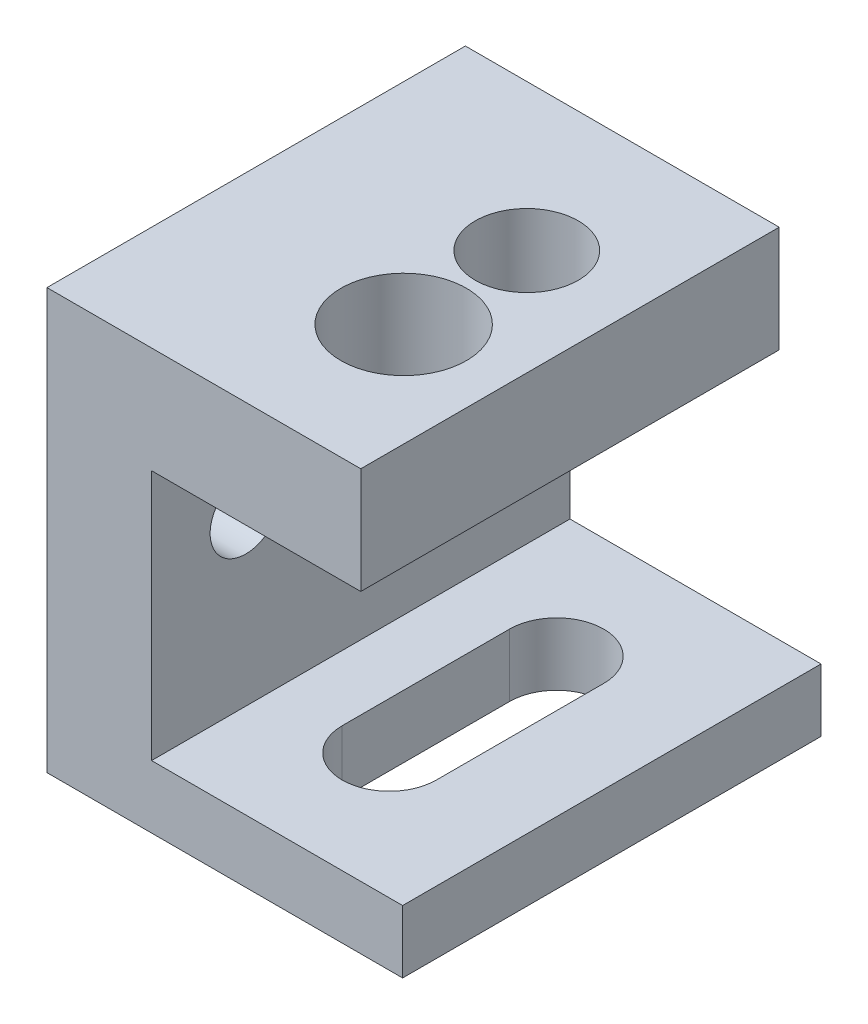
ISO-10303-21;
HEADER;
FILE_DESCRIPTION(('STEP AP214'),'2;1');
FILE_NAME('part.step','',(''),(''),'','','');
FILE_SCHEMA(('AUTOMOTIVE_DESIGN { 1 0 10303 214 1 1 1 1 }'));
ENDSEC;
DATA;
#1=APPLICATION_CONTEXT('core data for automotive mechanical design processes');
#2=APPLICATION_PROTOCOL_DEFINITION('international standard','automotive_design',2000,#1);
#3=PRODUCT_CONTEXT('',#1,'mechanical');
#4=PRODUCT('Part','Part','',(#3));
#5=PRODUCT_RELATED_PRODUCT_CATEGORY('part','',(#4));
#6=PRODUCT_DEFINITION_FORMATION('','',#4);
#7=PRODUCT_DEFINITION_CONTEXT('part definition',#1,'design');
#8=PRODUCT_DEFINITION('design','',#6,#7);
#9=PRODUCT_DEFINITION_SHAPE('','',#8);
#10=(LENGTH_UNIT() NAMED_UNIT(*) SI_UNIT(.MILLI.,.METRE.));
#11=(NAMED_UNIT(*) PLANE_ANGLE_UNIT() SI_UNIT($,.RADIAN.));
#12=(NAMED_UNIT(*) SI_UNIT($,.STERADIAN.) SOLID_ANGLE_UNIT());
#13=UNCERTAINTY_MEASURE_WITH_UNIT(LENGTH_MEASURE(1.E-05),#10,'distance_accuracy_value','');
#14=(GEOMETRIC_REPRESENTATION_CONTEXT(3) GLOBAL_UNCERTAINTY_ASSIGNED_CONTEXT((#13)) GLOBAL_UNIT_ASSIGNED_CONTEXT((#10,
#11,#12)) REPRESENTATION_CONTEXT('',''));
#15=CARTESIAN_POINT('',(0.,0.,0.));
#16=DIRECTION('',(0.,0.,1.));
#17=DIRECTION('',(1.,0.,0.));
#18=AXIS2_PLACEMENT_3D('',#15,#16,#17);
#19=CARTESIAN_POINT('',(-2.5,-15.,-10.));
#20=DIRECTION('',(-1.,0.,0.));
#21=DIRECTION('',(0.,0.,1.));
#22=AXIS2_PLACEMENT_3D('',#19,#20,#21);
#23=PLANE('',#22);
#24=CARTESIAN_POINT('',(-2.5,-4.,5.5));
#25=DIRECTION('',(1.,0.,0.));
#26=DIRECTION('',(0.,0.,-1.));
#27=AXIS2_PLACEMENT_3D('',#24,#25,#26);
#28=CIRCLE('',#27,1.69999999999999);
#29=CARTESIAN_POINT('',(-2.5,-4.,3.80000000000001));
#30=VERTEX_POINT('',#29);
#31=EDGE_CURVE('E187',#30,#30,#28,.T.);
#32=ORIENTED_EDGE('',*,*,#31,.F.);
#33=EDGE_LOOP('',(#32));
#34=FACE_BOUND('',#33,.T.);
#35=CARTESIAN_POINT('',(-2.5,-4.,-5.5));
#36=DIRECTION('',(1.,0.,0.));
#37=DIRECTION('',(0.,0.,-1.));
#38=AXIS2_PLACEMENT_3D('',#35,#36,#37);
#39=CIRCLE('',#38,1.69999999999999);
#40=CARTESIAN_POINT('',(-2.5,-4.,-7.19999999999999));
#41=VERTEX_POINT('',#40);
#42=EDGE_CURVE('E181',#41,#41,#39,.T.);
#43=ORIENTED_EDGE('',*,*,#42,.F.);
#44=EDGE_LOOP('',(#43));
#45=FACE_BOUND('',#44,.T.);
#46=DIRECTION('',(0.,0.,1.));
#47=VECTOR('',#46,1.);
#48=CARTESIAN_POINT('',(-2.5,-12.,-10.));
#49=LINE('',#48,#47);
#50=CARTESIAN_POINT('',(-2.5,-12.,-10.));
#51=VERTEX_POINT('',#50);
#52=CARTESIAN_POINT('',(-2.5,-12.,10.));
#53=VERTEX_POINT('',#52);
#54=EDGE_CURVE('E163',#51,#53,#49,.T.);
#55=ORIENTED_EDGE('',*,*,#54,.F.);
#56=DIRECTION('',(0.,1.,0.));
#57=VECTOR('',#56,1.);
#58=CARTESIAN_POINT('',(-2.5,-15.,-10.));
#59=LINE('',#58,#57);
#60=CARTESIAN_POINT('',(-2.5,0.,-10.));
#61=VERTEX_POINT('',#60);
#62=EDGE_CURVE('E219',#51,#61,#59,.T.);
#63=ORIENTED_EDGE('',*,*,#62,.T.);
#64=DIRECTION('',(0.,0.,1.));
#65=VECTOR('',#64,1.);
#66=CARTESIAN_POINT('',(-2.5,0.,-10.));
#67=LINE('',#66,#65);
#68=CARTESIAN_POINT('',(-2.5,0.,10.));
#69=VERTEX_POINT('',#68);
#70=EDGE_CURVE('E193',#61,#69,#67,.T.);
#71=ORIENTED_EDGE('',*,*,#70,.T.);
#72=DIRECTION('',(0.,1.,0.));
#73=VECTOR('',#72,1.);
#74=CARTESIAN_POINT('',(-2.5,-15.,10.));
#75=LINE('',#74,#73);
#76=EDGE_CURVE('E202',#53,#69,#75,.T.);
#77=ORIENTED_EDGE('',*,*,#76,.F.);
#78=EDGE_LOOP('',(#55,#63,#71,#77));
#79=FACE_BOUND('',#78,.T.);
#80=ADVANCED_FACE('F34',(#34,#45,#79),#23,.F.);
#81=CARTESIAN_POINT('',(0.,0.,0.));
#82=DIRECTION('',(0.,1.,0.));
#83=DIRECTION('',(0.,0.,1.));
#84=AXIS2_PLACEMENT_3D('',#81,#82,#83);
#85=PLANE('',#84);
#86=CARTESIAN_POINT('',(2.55115397628103,0.,3.));
#87=DIRECTION('',(0.,1.,0.));
#88=DIRECTION('',(0.,0.,1.));
#89=AXIS2_PLACEMENT_3D('',#86,#87,#88);
#90=CIRCLE('',#89,3.);
#91=CARTESIAN_POINT('',(2.55115397628103,0.,6.));
#92=VERTEX_POINT('',#91);
#93=EDGE_CURVE('E154',#92,#92,#90,.T.);
#94=ORIENTED_EDGE('',*,*,#93,.T.);
#95=EDGE_LOOP('',(#94));
#96=FACE_BOUND('',#95,.T.);
#97=CARTESIAN_POINT('',(2.43515046506104,0.,-3.));
#98=DIRECTION('',(0.,1.,0.));
#99=DIRECTION('',(0.,0.,1.));
#100=AXIS2_PLACEMENT_3D('',#97,#98,#99);
#101=CIRCLE('',#100,2.4638);
#102=CARTESIAN_POINT('',(2.43515046506104,0.,-0.536200000000003));
#103=VERTEX_POINT('',#102);
#104=EDGE_CURVE('E160',#103,#103,#101,.T.);
#105=ORIENTED_EDGE('',*,*,#104,.T.);
#106=EDGE_LOOP('',(#105));
#107=FACE_BOUND('',#106,.T.);
#108=ORIENTED_EDGE('',*,*,#70,.F.);
#109=DIRECTION('',(-1.,0.,0.));
#110=VECTOR('',#109,1.);
#111=CARTESIAN_POINT('',(7.5,0.,-10.));
#112=LINE('',#111,#110);
#113=CARTESIAN_POINT('',(7.5,0.,-10.));
#114=VERTEX_POINT('',#113);
#115=EDGE_CURVE('E309',#114,#61,#112,.T.);
#116=ORIENTED_EDGE('',*,*,#115,.F.);
#117=DIRECTION('',(0.,0.,-1.));
#118=VECTOR('',#117,1.);
#119=CARTESIAN_POINT('',(7.5,0.,10.));
#120=LINE('',#119,#118);
#121=CARTESIAN_POINT('',(7.5,0.,10.));
#122=VERTEX_POINT('',#121);
#123=EDGE_CURVE('E312',#122,#114,#120,.T.);
#124=ORIENTED_EDGE('',*,*,#123,.F.);
#125=DIRECTION('',(1.,0.,0.));
#126=VECTOR('',#125,1.);
#127=CARTESIAN_POINT('',(7.5,0.,10.));
#128=LINE('',#127,#126);
#129=EDGE_CURVE('E211',#69,#122,#128,.T.);
#130=ORIENTED_EDGE('',*,*,#129,.F.);
#131=EDGE_LOOP('',(#108,#116,#124,#130));
#132=FACE_BOUND('',#131,.T.);
#133=ADVANCED_FACE('F245',(#96,#107,#132),#85,.F.);
#134=CARTESIAN_POINT('',(-7.5,5.08,10.));
#135=DIRECTION('',(1.,0.,0.));
#136=DIRECTION('',(0.,0.,-1.));
#137=AXIS2_PLACEMENT_3D('',#134,#135,#136);
#138=PLANE('',#137);
#139=CARTESIAN_POINT('',(-7.5,-4.,-5.5));
#140=DIRECTION('',(1.,0.,0.));
#141=DIRECTION('',(0.,0.,-1.));
#142=AXIS2_PLACEMENT_3D('',#139,#140,#141);
#143=CIRCLE('',#142,1.7);
#144=CARTESIAN_POINT('',(-7.5,-4.,-7.2));
#145=VERTEX_POINT('',#144);
#146=EDGE_CURVE('E184',#145,#145,#143,.T.);
#147=ORIENTED_EDGE('',*,*,#146,.T.);
#148=EDGE_LOOP('',(#147));
#149=FACE_BOUND('',#148,.T.);
#150=CARTESIAN_POINT('',(-7.50000000000001,-4.,5.5));
#151=DIRECTION('',(1.,0.,0.));
#152=DIRECTION('',(0.,0.,-1.));
#153=AXIS2_PLACEMENT_3D('',#150,#151,#152);
#154=CIRCLE('',#153,1.7);
#155=CARTESIAN_POINT('',(-7.50000000000001,-4.,3.8));
#156=VERTEX_POINT('',#155);
#157=EDGE_CURVE('E190',#156,#156,#154,.T.);
#158=ORIENTED_EDGE('',*,*,#157,.T.);
#159=EDGE_LOOP('',(#158));
#160=FACE_BOUND('',#159,.T.);
#161=DIRECTION('',(0.,-1.,0.));
#162=VECTOR('',#161,1.);
#163=CARTESIAN_POINT('',(-7.5,5.08,-10.));
#164=LINE('',#163,#162);
#165=CARTESIAN_POINT('',(-7.5,5.08,-10.));
#166=VERTEX_POINT('',#165);
#167=CARTESIAN_POINT('',(-7.5,-15.,-10.));
#168=VERTEX_POINT('',#167);
#169=EDGE_CURVE('E288',#166,#168,#164,.T.);
#170=ORIENTED_EDGE('',*,*,#169,.T.);
#171=DIRECTION('',(0.,0.,-1.));
#172=VECTOR('',#171,1.);
#173=CARTESIAN_POINT('',(-7.5,-15.,-10.));
#174=LINE('',#173,#172);
#175=CARTESIAN_POINT('',(-7.5,-15.,10.));
#176=VERTEX_POINT('',#175);
#177=EDGE_CURVE('E194',#176,#168,#174,.T.);
#178=ORIENTED_EDGE('',*,*,#177,.F.);
#179=DIRECTION('',(0.,-1.,0.));
#180=VECTOR('',#179,1.);
#181=CARTESIAN_POINT('',(-7.5,5.08,10.));
#182=LINE('',#181,#180);
#183=CARTESIAN_POINT('',(-7.5,5.08,10.));
#184=VERTEX_POINT('',#183);
#185=EDGE_CURVE('E223',#184,#176,#182,.T.);
#186=ORIENTED_EDGE('',*,*,#185,.F.);
#187=DIRECTION('',(0.,0.,1.));
#188=VECTOR('',#187,1.);
#189=CARTESIAN_POINT('',(-7.5,5.08,10.));
#190=LINE('',#189,#188);
#191=EDGE_CURVE('E205',#166,#184,#190,.T.);
#192=ORIENTED_EDGE('',*,*,#191,.F.);
#193=EDGE_LOOP('',(#170,#178,#186,#192));
#194=FACE_BOUND('',#193,.T.);
#195=ADVANCED_FACE('F36',(#149,#160,#194),#138,.F.);
#196=CARTESIAN_POINT('',(7.5,5.08,10.));
#197=DIRECTION('',(0.,0.,-1.));
#198=DIRECTION('',(-1.,0.,0.));
#199=AXIS2_PLACEMENT_3D('',#196,#197,#198);
#200=PLANE('',#199);
#201=ORIENTED_EDGE('',*,*,#185,.T.);
#202=DIRECTION('',(-1.,0.,0.));
#203=VECTOR('',#202,1.);
#204=CARTESIAN_POINT('',(-7.5,-15.,10.));
#205=LINE('',#204,#203);
#206=CARTESIAN_POINT('',(9.5,-15.,10.));
#207=VERTEX_POINT('',#206);
#208=EDGE_CURVE('E199',#207,#176,#205,.T.);
#209=ORIENTED_EDGE('',*,*,#208,.F.);
#210=DIRECTION('',(0.,-1.,0.));
#211=VECTOR('',#210,1.);
#212=CARTESIAN_POINT('',(9.5,-15.,10.));
#213=LINE('',#212,#211);
#214=CARTESIAN_POINT('',(9.5,-12.,10.));
#215=VERTEX_POINT('',#214);
#216=EDGE_CURVE('E169',#215,#207,#213,.T.);
#217=ORIENTED_EDGE('',*,*,#216,.F.);
#218=DIRECTION('',(-1.,0.,0.));
#219=VECTOR('',#218,1.);
#220=CARTESIAN_POINT('',(9.5,-12.,10.));
#221=LINE('',#220,#219);
#222=EDGE_CURVE('E175',#215,#53,#221,.T.);
#223=ORIENTED_EDGE('',*,*,#222,.T.);
#224=ORIENTED_EDGE('',*,*,#76,.T.);
#225=ORIENTED_EDGE('',*,*,#129,.T.);
#226=DIRECTION('',(0.,-1.,0.));
#227=VECTOR('',#226,1.);
#228=CARTESIAN_POINT('',(7.5,5.08,10.));
#229=LINE('',#228,#227);
#230=CARTESIAN_POINT('',(7.5,5.08,10.));
#231=VERTEX_POINT('',#230);
#232=EDGE_CURVE('E284',#231,#122,#229,.T.);
#233=ORIENTED_EDGE('',*,*,#232,.F.);
#234=DIRECTION('',(1.,0.,0.));
#235=VECTOR('',#234,1.);
#236=CARTESIAN_POINT('',(7.5,5.08,10.));
#237=LINE('',#236,#235);
#238=EDGE_CURVE('E279',#184,#231,#237,.T.);
#239=ORIENTED_EDGE('',*,*,#238,.F.);
#240=EDGE_LOOP('',(#201,#209,#217,#223,#224,#225,#233,#239));
#241=FACE_BOUND('',#240,.T.);
#242=ADVANCED_FACE('F268',(#241),#200,.F.);
#243=CARTESIAN_POINT('',(7.5,5.08,10.));
#244=DIRECTION('',(-1.,0.,0.));
#245=DIRECTION('',(0.,0.,1.));
#246=AXIS2_PLACEMENT_3D('',#243,#244,#245);
#247=PLANE('',#246);
#248=ORIENTED_EDGE('',*,*,#123,.T.);
#249=DIRECTION('',(0.,-1.,0.));
#250=VECTOR('',#249,1.);
#251=CARTESIAN_POINT('',(7.5,5.08,-10.));
#252=LINE('',#251,#250);
#253=CARTESIAN_POINT('',(7.5,5.08,-10.));
#254=VERTEX_POINT('',#253);
#255=EDGE_CURVE('E291',#254,#114,#252,.T.);
#256=ORIENTED_EDGE('',*,*,#255,.F.);
#257=DIRECTION('',(0.,0.,-1.));
#258=VECTOR('',#257,1.);
#259=CARTESIAN_POINT('',(7.5,5.08,10.));
#260=LINE('',#259,#258);
#261=EDGE_CURVE('E320',#231,#254,#260,.T.);
#262=ORIENTED_EDGE('',*,*,#261,.F.);
#263=ORIENTED_EDGE('',*,*,#232,.T.);
#264=EDGE_LOOP('',(#248,#256,#262,#263));
#265=FACE_BOUND('',#264,.T.);
#266=ADVANCED_FACE('F265',(#265),#247,.F.);
#267=CARTESIAN_POINT('',(7.5,5.08,-10.));
#268=DIRECTION('',(0.,0.,1.));
#269=DIRECTION('',(1.,0.,0.));
#270=AXIS2_PLACEMENT_3D('',#267,#268,#269);
#271=PLANE('',#270);
#272=ORIENTED_EDGE('',*,*,#115,.T.);
#273=ORIENTED_EDGE('',*,*,#62,.F.);
#274=DIRECTION('',(-1.,0.,0.));
#275=VECTOR('',#274,1.);
#276=CARTESIAN_POINT('',(9.5,-12.,-10.));
#277=LINE('',#276,#275);
#278=CARTESIAN_POINT('',(9.5,-12.,-10.));
#279=VERTEX_POINT('',#278);
#280=EDGE_CURVE('E179',#279,#51,#277,.T.);
#281=ORIENTED_EDGE('',*,*,#280,.F.);
#282=DIRECTION('',(0.,1.,0.));
#283=VECTOR('',#282,1.);
#284=CARTESIAN_POINT('',(9.5,-15.,-10.));
#285=LINE('',#284,#283);
#286=CARTESIAN_POINT('',(9.5,-15.,-10.));
#287=VERTEX_POINT('',#286);
#288=EDGE_CURVE('E164',#287,#279,#285,.T.);
#289=ORIENTED_EDGE('',*,*,#288,.F.);
#290=DIRECTION('',(1.,0.,0.));
#291=VECTOR('',#290,1.);
#292=CARTESIAN_POINT('',(-7.5,-15.,-10.));
#293=LINE('',#292,#291);
#294=EDGE_CURVE('E197',#168,#287,#293,.T.);
#295=ORIENTED_EDGE('',*,*,#294,.F.);
#296=ORIENTED_EDGE('',*,*,#169,.F.);
#297=DIRECTION('',(-1.,0.,0.));
#298=VECTOR('',#297,1.);
#299=CARTESIAN_POINT('',(7.5,5.08,-10.));
#300=LINE('',#299,#298);
#301=EDGE_CURVE('E292',#254,#166,#300,.T.);
#302=ORIENTED_EDGE('',*,*,#301,.F.);
#303=ORIENTED_EDGE('',*,*,#255,.T.);
#304=EDGE_LOOP('',(#272,#273,#281,#289,#295,#296,#302,#303));
#305=FACE_BOUND('',#304,.T.);
#306=ADVANCED_FACE('F260',(#305),#271,.F.);
#307=CARTESIAN_POINT('',(0.,5.08,0.));
#308=DIRECTION('',(0.,1.,0.));
#309=DIRECTION('',(0.,0.,1.));
#310=AXIS2_PLACEMENT_3D('',#307,#308,#309);
#311=PLANE('',#310);
#312=CARTESIAN_POINT('',(2.55115397628103,5.08,3.));
#313=DIRECTION('',(0.,1.,0.));
#314=DIRECTION('',(0.,0.,1.));
#315=AXIS2_PLACEMENT_3D('',#312,#313,#314);
#316=CIRCLE('',#315,3.);
#317=CARTESIAN_POINT('',(2.55115397628103,5.08,6.));
#318=VERTEX_POINT('',#317);
#319=EDGE_CURVE('E149',#318,#318,#316,.T.);
#320=ORIENTED_EDGE('',*,*,#319,.F.);
#321=EDGE_LOOP('',(#320));
#322=FACE_BOUND('',#321,.T.);
#323=CARTESIAN_POINT('',(2.43515046506104,5.08,-3.));
#324=DIRECTION('',(0.,1.,0.));
#325=DIRECTION('',(0.,0.,1.));
#326=AXIS2_PLACEMENT_3D('',#323,#324,#325);
#327=CIRCLE('',#326,2.4638);
#328=CARTESIAN_POINT('',(2.43515046506104,5.08,-0.536200000000003));
#329=VERTEX_POINT('',#328);
#330=EDGE_CURVE('E157',#329,#329,#327,.T.);
#331=ORIENTED_EDGE('',*,*,#330,.F.);
#332=EDGE_LOOP('',(#331));
#333=FACE_BOUND('',#332,.T.);
#334=ORIENTED_EDGE('',*,*,#191,.T.);
#335=ORIENTED_EDGE('',*,*,#238,.T.);
#336=ORIENTED_EDGE('',*,*,#261,.T.);
#337=ORIENTED_EDGE('',*,*,#301,.T.);
#338=EDGE_LOOP('',(#334,#335,#336,#337));
#339=FACE_BOUND('',#338,.T.);
#340=ADVANCED_FACE('F258',(#322,#333,#339),#311,.T.);
#341=CARTESIAN_POINT('',(0.,-15.,0.));
#342=DIRECTION('',(0.,1.,0.));
#343=DIRECTION('',(0.,0.,1.));
#344=AXIS2_PLACEMENT_3D('',#341,#342,#343);
#345=PLANE('',#344);
#346=DIRECTION('',(0.,0.,1.));
#347=VECTOR('',#346,1.);
#348=CARTESIAN_POINT('',(5.11152957496108,-15.,-4.));
#349=LINE('',#348,#347);
#350=CARTESIAN_POINT('',(5.11152957496108,-15.,-4.));
#351=VERTEX_POINT('',#350);
#352=CARTESIAN_POINT('',(5.11152957496108,-15.,4.));
#353=VERTEX_POINT('',#352);
#354=EDGE_CURVE('E135',#351,#353,#349,.T.);
#355=ORIENTED_EDGE('',*,*,#354,.F.);
#356=CARTESIAN_POINT('',(2.86152957496108,-15.,-4.));
#357=DIRECTION('',(0.,-1.,0.));
#358=DIRECTION('',(0.,0.,-1.));
#359=AXIS2_PLACEMENT_3D('',#356,#357,#358);
#360=CIRCLE('',#359,2.25);
#361=CARTESIAN_POINT('',(0.611529574961084,-15.,-4.));
#362=VERTEX_POINT('',#361);
#363=EDGE_CURVE('E49',#362,#351,#360,.T.);
#364=ORIENTED_EDGE('',*,*,#363,.F.);
#365=DIRECTION('',(0.,0.,-1.));
#366=VECTOR('',#365,1.);
#367=CARTESIAN_POINT('',(0.611529574961084,-15.,-4.));
#368=LINE('',#367,#366);
#369=CARTESIAN_POINT('',(0.611529574961084,-15.,4.));
#370=VERTEX_POINT('',#369);
#371=EDGE_CURVE('E142',#370,#362,#368,.T.);
#372=ORIENTED_EDGE('',*,*,#371,.F.);
#373=CARTESIAN_POINT('',(2.86152957496108,-15.,4.));
#374=DIRECTION('',(0.,-1.,0.));
#375=DIRECTION('',(0.,0.,-1.));
#376=AXIS2_PLACEMENT_3D('',#373,#374,#375);
#377=CIRCLE('',#376,2.25);
#378=EDGE_CURVE('E126',#353,#370,#377,.T.);
#379=ORIENTED_EDGE('',*,*,#378,.F.);
#380=EDGE_LOOP('',(#355,#364,#372,#379));
#381=FACE_BOUND('',#380,.T.);
#382=ORIENTED_EDGE('',*,*,#177,.T.);
#383=ORIENTED_EDGE('',*,*,#294,.T.);
#384=DIRECTION('',(0.,0.,-1.));
#385=VECTOR('',#384,1.);
#386=CARTESIAN_POINT('',(9.5,-15.,-10.));
#387=LINE('',#386,#385);
#388=EDGE_CURVE('E172',#207,#287,#387,.T.);
#389=ORIENTED_EDGE('',*,*,#388,.F.);
#390=ORIENTED_EDGE('',*,*,#208,.T.);
#391=EDGE_LOOP('',(#382,#383,#389,#390));
#392=FACE_BOUND('',#391,.T.);
#393=ADVANCED_FACE('F139',(#381,#392),#345,.F.);
#394=CARTESIAN_POINT('',(-2.5,-4.,5.5));
#395=DIRECTION('',(1.,0.,0.));
#396=DIRECTION('',(0.,0.,-1.));
#397=AXIS2_PLACEMENT_3D('',#394,#395,#396);
#398=CYLINDRICAL_SURFACE('',#397,1.69999999999999);
#399=ORIENTED_EDGE('',*,*,#157,.F.);
#400=EDGE_LOOP('',(#399));
#401=FACE_BOUND('',#400,.T.);
#402=ORIENTED_EDGE('',*,*,#31,.T.);
#403=EDGE_LOOP('',(#402));
#404=FACE_BOUND('',#403,.T.);
#405=ADVANCED_FACE('F333',(#401,#404),#398,.F.);
#406=CARTESIAN_POINT('',(-2.5,-4.,-5.5));
#407=DIRECTION('',(1.,0.,0.));
#408=DIRECTION('',(0.,0.,-1.));
#409=AXIS2_PLACEMENT_3D('',#406,#407,#408);
#410=CYLINDRICAL_SURFACE('',#409,1.69999999999999);
#411=ORIENTED_EDGE('',*,*,#146,.F.);
#412=EDGE_LOOP('',(#411));
#413=FACE_BOUND('',#412,.T.);
#414=ORIENTED_EDGE('',*,*,#42,.T.);
#415=EDGE_LOOP('',(#414));
#416=FACE_BOUND('',#415,.T.);
#417=ADVANCED_FACE('F326',(#413,#416),#410,.F.);
#418=CARTESIAN_POINT('',(9.5,-12.,-10.));
#419=DIRECTION('',(0.,-1.,0.));
#420=DIRECTION('',(0.,0.,-1.));
#421=AXIS2_PLACEMENT_3D('',#418,#419,#420);
#422=PLANE('',#421);
#423=DIRECTION('',(0.,0.,-1.));
#424=VECTOR('',#423,1.);
#425=CARTESIAN_POINT('',(0.611529574961084,-12.,-10.));
#426=LINE('',#425,#424);
#427=CARTESIAN_POINT('',(0.611529574961084,-12.,4.));
#428=VERTEX_POINT('',#427);
#429=CARTESIAN_POINT('',(0.611529574961084,-12.,-4.));
#430=VERTEX_POINT('',#429);
#431=EDGE_CURVE('E42',#428,#430,#426,.T.);
#432=ORIENTED_EDGE('',*,*,#431,.T.);
#433=CARTESIAN_POINT('',(2.86152957496108,-12.,-4.));
#434=DIRECTION('',(0.,-1.,0.));
#435=DIRECTION('',(0.,0.,-1.));
#436=AXIS2_PLACEMENT_3D('',#433,#434,#435);
#437=CIRCLE('',#436,2.25);
#438=CARTESIAN_POINT('',(5.11152957496108,-12.,-4.));
#439=VERTEX_POINT('',#438);
#440=EDGE_CURVE('E11',#430,#439,#437,.T.);
#441=ORIENTED_EDGE('',*,*,#440,.T.);
#442=DIRECTION('',(0.,0.,1.));
#443=VECTOR('',#442,1.);
#444=CARTESIAN_POINT('',(5.11152957496108,-12.,-10.));
#445=LINE('',#444,#443);
#446=CARTESIAN_POINT('',(5.11152957496108,-12.,4.));
#447=VERTEX_POINT('',#446);
#448=EDGE_CURVE('E221',#439,#447,#445,.T.);
#449=ORIENTED_EDGE('',*,*,#448,.T.);
#450=CARTESIAN_POINT('',(2.86152957496108,-12.,4.));
#451=DIRECTION('',(0.,-1.,0.));
#452=DIRECTION('',(0.,0.,-1.));
#453=AXIS2_PLACEMENT_3D('',#450,#451,#452);
#454=CIRCLE('',#453,2.25);
#455=EDGE_CURVE('E129',#447,#428,#454,.T.);
#456=ORIENTED_EDGE('',*,*,#455,.T.);
#457=EDGE_LOOP('',(#432,#441,#449,#456));
#458=FACE_BOUND('',#457,.T.);
#459=ORIENTED_EDGE('',*,*,#54,.T.);
#460=ORIENTED_EDGE('',*,*,#222,.F.);
#461=DIRECTION('',(0.,0.,1.));
#462=VECTOR('',#461,1.);
#463=CARTESIAN_POINT('',(9.5,-12.,-10.));
#464=LINE('',#463,#462);
#465=EDGE_CURVE('E167',#279,#215,#464,.T.);
#466=ORIENTED_EDGE('',*,*,#465,.F.);
#467=ORIENTED_EDGE('',*,*,#280,.T.);
#468=EDGE_LOOP('',(#459,#460,#466,#467));
#469=FACE_BOUND('',#468,.T.);
#470=ADVANCED_FACE('F226',(#458,#469),#422,.F.);
#471=CARTESIAN_POINT('',(9.5,0.,0.));
#472=DIRECTION('',(1.,0.,0.));
#473=DIRECTION('',(0.,0.,-1.));
#474=AXIS2_PLACEMENT_3D('',#471,#472,#473);
#475=PLANE('',#474);
#476=ORIENTED_EDGE('',*,*,#288,.T.);
#477=ORIENTED_EDGE('',*,*,#465,.T.);
#478=ORIENTED_EDGE('',*,*,#216,.T.);
#479=ORIENTED_EDGE('',*,*,#388,.T.);
#480=EDGE_LOOP('',(#476,#477,#478,#479));
#481=FACE_BOUND('',#480,.T.);
#482=ADVANCED_FACE('F298',(#481),#475,.T.);
#483=CARTESIAN_POINT('',(2.43515046506104,-6.92,-3.));
#484=DIRECTION('',(0.,1.,0.));
#485=DIRECTION('',(0.,0.,1.));
#486=AXIS2_PLACEMENT_3D('',#483,#484,#485);
#487=CYLINDRICAL_SURFACE('',#486,2.4638);
#488=ORIENTED_EDGE('',*,*,#330,.T.);
#489=EDGE_LOOP('',(#488));
#490=FACE_BOUND('',#489,.T.);
#491=ORIENTED_EDGE('',*,*,#104,.F.);
#492=EDGE_LOOP('',(#491));
#493=FACE_BOUND('',#492,.T.);
#494=ADVANCED_FACE('F240',(#490,#493),#487,.F.);
#495=CARTESIAN_POINT('',(2.55115397628103,-6.92,3.));
#496=DIRECTION('',(0.,1.,0.));
#497=DIRECTION('',(0.,0.,1.));
#498=AXIS2_PLACEMENT_3D('',#495,#496,#497);
#499=CYLINDRICAL_SURFACE('',#498,3.);
#500=ORIENTED_EDGE('',*,*,#319,.T.);
#501=EDGE_LOOP('',(#500));
#502=FACE_BOUND('',#501,.T.);
#503=ORIENTED_EDGE('',*,*,#93,.F.);
#504=EDGE_LOOP('',(#503));
#505=FACE_BOUND('',#504,.T.);
#506=ADVANCED_FACE('F233',(#502,#505),#499,.F.);
#507=CARTESIAN_POINT('',(2.86152957496108,-3.,-4.));
#508=DIRECTION('',(0.,-1.,0.));
#509=DIRECTION('',(0.,0.,-1.));
#510=AXIS2_PLACEMENT_3D('',#507,#508,#509);
#511=CYLINDRICAL_SURFACE('',#510,2.25);
#512=DIRECTION('',(0.,-1.,0.));
#513=VECTOR('',#512,1.);
#514=CARTESIAN_POINT('',(0.611529574961084,-3.,-4.));
#515=LINE('',#514,#513);
#516=EDGE_CURVE('E147',#430,#362,#515,.T.);
#517=ORIENTED_EDGE('',*,*,#516,.T.);
#518=ORIENTED_EDGE('',*,*,#363,.T.);
#519=DIRECTION('',(0.,-1.,0.));
#520=VECTOR('',#519,1.);
#521=CARTESIAN_POINT('',(5.11152957496108,-3.,-4.));
#522=LINE('',#521,#520);
#523=EDGE_CURVE('E132',#439,#351,#522,.T.);
#524=ORIENTED_EDGE('',*,*,#523,.F.);
#525=ORIENTED_EDGE('',*,*,#440,.F.);
#526=EDGE_LOOP('',(#517,#518,#524,#525));
#527=FACE_BOUND('',#526,.T.);
#528=ADVANCED_FACE('F231',(#527),#511,.F.);
#529=CARTESIAN_POINT('',(0.611529574961084,-3.,-4.));
#530=DIRECTION('',(-1.,0.,0.));
#531=DIRECTION('',(0.,0.,1.));
#532=AXIS2_PLACEMENT_3D('',#529,#530,#531);
#533=PLANE('',#532);
#534=DIRECTION('',(0.,-1.,0.));
#535=VECTOR('',#534,1.);
#536=CARTESIAN_POINT('',(0.611529574961084,-3.,4.));
#537=LINE('',#536,#535);
#538=EDGE_CURVE('E131',#428,#370,#537,.T.);
#539=ORIENTED_EDGE('',*,*,#538,.T.);
#540=ORIENTED_EDGE('',*,*,#371,.T.);
#541=ORIENTED_EDGE('',*,*,#516,.F.);
#542=ORIENTED_EDGE('',*,*,#431,.F.);
#543=EDGE_LOOP('',(#539,#540,#541,#542));
#544=FACE_BOUND('',#543,.T.);
#545=ADVANCED_FACE('F230',(#544),#533,.F.);
#546=CARTESIAN_POINT('',(2.86152957496108,-3.,4.));
#547=DIRECTION('',(0.,-1.,0.));
#548=DIRECTION('',(0.,0.,-1.));
#549=AXIS2_PLACEMENT_3D('',#546,#547,#548);
#550=CYLINDRICAL_SURFACE('',#549,2.25);
#551=DIRECTION('',(0.,-1.,0.));
#552=VECTOR('',#551,1.);
#553=CARTESIAN_POINT('',(5.11152957496108,-3.,4.));
#554=LINE('',#553,#552);
#555=EDGE_CURVE('E57',#447,#353,#554,.T.);
#556=ORIENTED_EDGE('',*,*,#555,.T.);
#557=ORIENTED_EDGE('',*,*,#378,.T.);
#558=ORIENTED_EDGE('',*,*,#538,.F.);
#559=ORIENTED_EDGE('',*,*,#455,.F.);
#560=EDGE_LOOP('',(#556,#557,#558,#559));
#561=FACE_BOUND('',#560,.T.);
#562=ADVANCED_FACE('F123',(#561),#550,.F.);
#563=CARTESIAN_POINT('',(5.11152957496108,-3.,-4.));
#564=DIRECTION('',(1.,0.,0.));
#565=DIRECTION('',(0.,0.,-1.));
#566=AXIS2_PLACEMENT_3D('',#563,#564,#565);
#567=PLANE('',#566);
#568=ORIENTED_EDGE('',*,*,#523,.T.);
#569=ORIENTED_EDGE('',*,*,#354,.T.);
#570=ORIENTED_EDGE('',*,*,#555,.F.);
#571=ORIENTED_EDGE('',*,*,#448,.F.);
#572=EDGE_LOOP('',(#568,#569,#570,#571));
#573=FACE_BOUND('',#572,.T.);
#574=ADVANCED_FACE('F136',(#573),#567,.F.);
#575=CLOSED_SHELL('',(#80,#133,#195,#242,#266,#306,#340,#393,#405,#417,#470,#482,#494,#506,#528,
#545,#562,#574));
#576=MANIFOLD_SOLID_BREP('B2',#575);
#577=ADVANCED_BREP_SHAPE_REPRESENTATION('',(#18,#576),#14);
#578=SHAPE_DEFINITION_REPRESENTATION(#9,#577);
ENDSEC;
END-ISO-10303-21;
